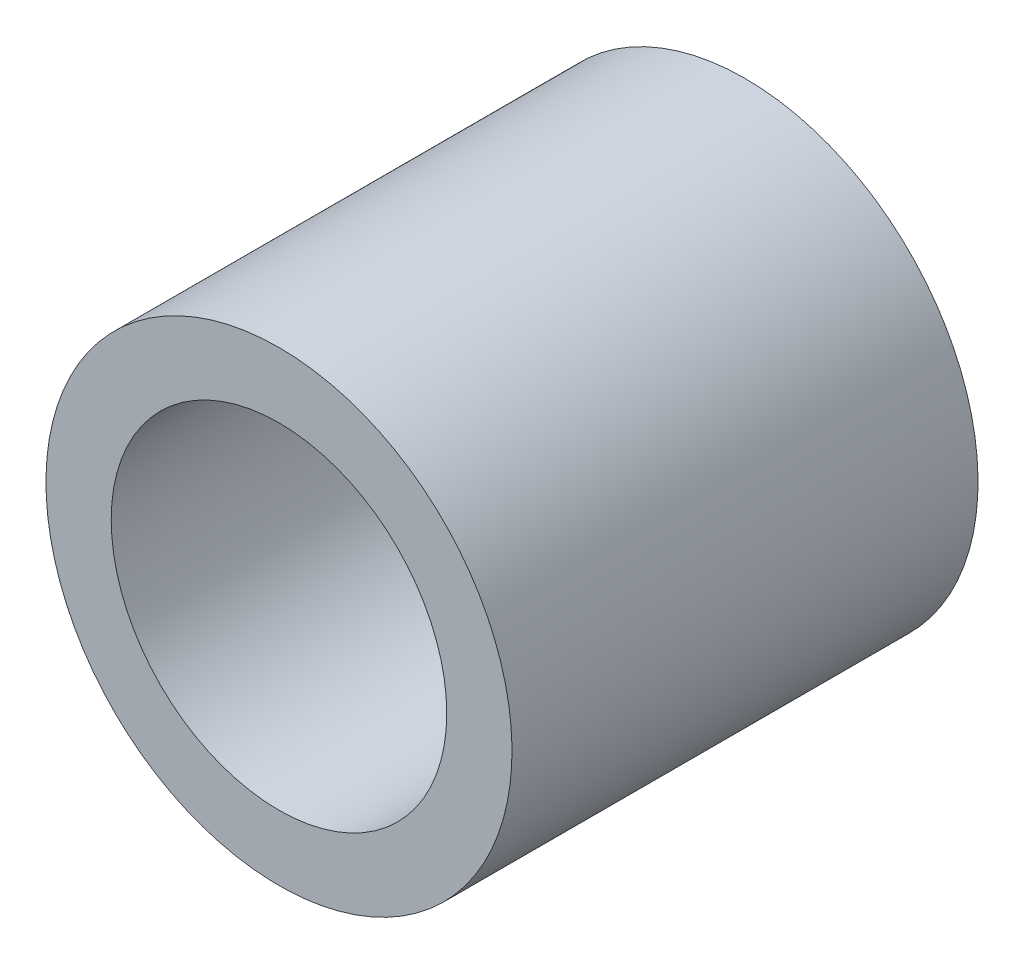
ISO-10303-21;
HEADER;
FILE_DESCRIPTION(('STEP AP214'),'2;1');
FILE_NAME('part.step','',(''),(''),'','','');
FILE_SCHEMA(('AUTOMOTIVE_DESIGN { 1 0 10303 214 1 1 1 1 }'));
ENDSEC;
DATA;
#1=APPLICATION_CONTEXT('core data for automotive mechanical design processes');
#2=APPLICATION_PROTOCOL_DEFINITION('international standard','automotive_design',2000,#1);
#3=PRODUCT_CONTEXT('',#1,'mechanical');
#4=PRODUCT('Part','Part','',(#3));
#5=PRODUCT_RELATED_PRODUCT_CATEGORY('part','',(#4));
#6=PRODUCT_DEFINITION_FORMATION('','',#4);
#7=PRODUCT_DEFINITION_CONTEXT('part definition',#1,'design');
#8=PRODUCT_DEFINITION('design','',#6,#7);
#9=PRODUCT_DEFINITION_SHAPE('','',#8);
#10=(LENGTH_UNIT() NAMED_UNIT(*) SI_UNIT(.MILLI.,.METRE.));
#11=(NAMED_UNIT(*) PLANE_ANGLE_UNIT() SI_UNIT($,.RADIAN.));
#12=(NAMED_UNIT(*) SI_UNIT($,.STERADIAN.) SOLID_ANGLE_UNIT());
#13=UNCERTAINTY_MEASURE_WITH_UNIT(LENGTH_MEASURE(1.E-05),#10,'distance_accuracy_value','');
#14=(GEOMETRIC_REPRESENTATION_CONTEXT(3) GLOBAL_UNCERTAINTY_ASSIGNED_CONTEXT((#13)) GLOBAL_UNIT_ASSIGNED_CONTEXT((#10,
#11,#12)) REPRESENTATION_CONTEXT('',''));
#15=CARTESIAN_POINT('',(0.,0.,0.));
#16=DIRECTION('',(0.,0.,1.));
#17=DIRECTION('',(1.,0.,0.));
#18=AXIS2_PLACEMENT_3D('',#15,#16,#17);
#19=CARTESIAN_POINT('',(0.,0.,1.5875));
#20=DIRECTION('',(0.,0.,-1.));
#21=DIRECTION('',(0.,1.,0.));
#22=AXIS2_PLACEMENT_3D('',#19,#20,#21);
#23=CYLINDRICAL_SURFACE('',#22,1.5875);
#24=CARTESIAN_POINT('',(0.,0.,1.5875));
#25=DIRECTION('',(0.,0.,-1.));
#26=DIRECTION('',(0.,1.,0.));
#27=AXIS2_PLACEMENT_3D('',#24,#25,#26);
#28=CIRCLE('',#27,1.5875);
#29=CARTESIAN_POINT('',(0.,1.5875,1.5875));
#30=VERTEX_POINT('',#29);
#31=EDGE_CURVE('E18',#30,#30,#28,.F.);
#32=ORIENTED_EDGE('',*,*,#31,.F.);
#33=EDGE_LOOP('',(#32));
#34=FACE_BOUND('',#33,.T.);
#35=CARTESIAN_POINT('',(0.,0.,-1.5875));
#36=DIRECTION('',(0.,0.,-1.));
#37=DIRECTION('',(0.,1.,0.));
#38=AXIS2_PLACEMENT_3D('',#35,#36,#37);
#39=CIRCLE('',#38,1.5875);
#40=CARTESIAN_POINT('',(0.,1.5875,-1.5875));
#41=VERTEX_POINT('',#40);
#42=EDGE_CURVE('E27',#41,#41,#39,.F.);
#43=ORIENTED_EDGE('',*,*,#42,.T.);
#44=EDGE_LOOP('',(#43));
#45=FACE_BOUND('',#44,.T.);
#46=ADVANCED_FACE('F14',(#34,#45),#23,.T.);
#47=CARTESIAN_POINT('',(-1.60655,-1.60655,1.5875));
#48=DIRECTION('',(0.,0.,1.));
#49=DIRECTION('',(1.,0.,0.));
#50=AXIS2_PLACEMENT_3D('',#47,#48,#49);
#51=PLANE('',#50);
#52=CARTESIAN_POINT('',(0.,0.,1.5875));
#53=DIRECTION('',(0.,0.,-1.));
#54=DIRECTION('',(0.,1.,0.));
#55=AXIS2_PLACEMENT_3D('',#52,#53,#54);
#56=CIRCLE('',#55,1.143);
#57=CARTESIAN_POINT('',(0.,1.143,1.5875));
#58=VERTEX_POINT('',#57);
#59=EDGE_CURVE('E22',#58,#58,#56,.F.);
#60=ORIENTED_EDGE('',*,*,#59,.F.);
#61=EDGE_LOOP('',(#60));
#62=FACE_BOUND('',#61,.T.);
#63=ORIENTED_EDGE('',*,*,#31,.T.);
#64=EDGE_LOOP('',(#63));
#65=FACE_BOUND('',#64,.T.);
#66=ADVANCED_FACE('F35',(#62,#65),#51,.T.);
#67=CARTESIAN_POINT('',(-1.60655,-1.60655,-1.5875));
#68=DIRECTION('',(0.,0.,1.));
#69=DIRECTION('',(1.,0.,0.));
#70=AXIS2_PLACEMENT_3D('',#67,#68,#69);
#71=PLANE('',#70);
#72=CARTESIAN_POINT('',(0.,0.,-1.5875));
#73=DIRECTION('',(0.,0.,-1.));
#74=DIRECTION('',(0.,1.,0.));
#75=AXIS2_PLACEMENT_3D('',#72,#73,#74);
#76=CIRCLE('',#75,1.143);
#77=CARTESIAN_POINT('',(0.,1.143,-1.5875));
#78=VERTEX_POINT('',#77);
#79=EDGE_CURVE('E9',#78,#78,#76,.T.);
#80=ORIENTED_EDGE('',*,*,#79,.F.);
#81=EDGE_LOOP('',(#80));
#82=FACE_BOUND('',#81,.T.);
#83=ORIENTED_EDGE('',*,*,#42,.F.);
#84=EDGE_LOOP('',(#83));
#85=FACE_BOUND('',#84,.T.);
#86=ADVANCED_FACE('F16',(#82,#85),#71,.F.);
#87=CARTESIAN_POINT('',(0.,0.,1.5875));
#88=DIRECTION('',(0.,0.,-1.));
#89=DIRECTION('',(0.,1.,0.));
#90=AXIS2_PLACEMENT_3D('',#87,#88,#89);
#91=CYLINDRICAL_SURFACE('',#90,1.143);
#92=ORIENTED_EDGE('',*,*,#79,.T.);
#93=EDGE_LOOP('',(#92));
#94=FACE_BOUND('',#93,.T.);
#95=ORIENTED_EDGE('',*,*,#59,.T.);
#96=EDGE_LOOP('',(#95));
#97=FACE_BOUND('',#96,.T.);
#98=ADVANCED_FACE('F45',(#94,#97),#91,.F.);
#99=CLOSED_SHELL('',(#46,#66,#86,#98));
#100=MANIFOLD_SOLID_BREP('B1',#99);
#101=ADVANCED_BREP_SHAPE_REPRESENTATION('',(#18,#100),#14);
#102=SHAPE_DEFINITION_REPRESENTATION(#9,#101);
ENDSEC;
END-ISO-10303-21;
